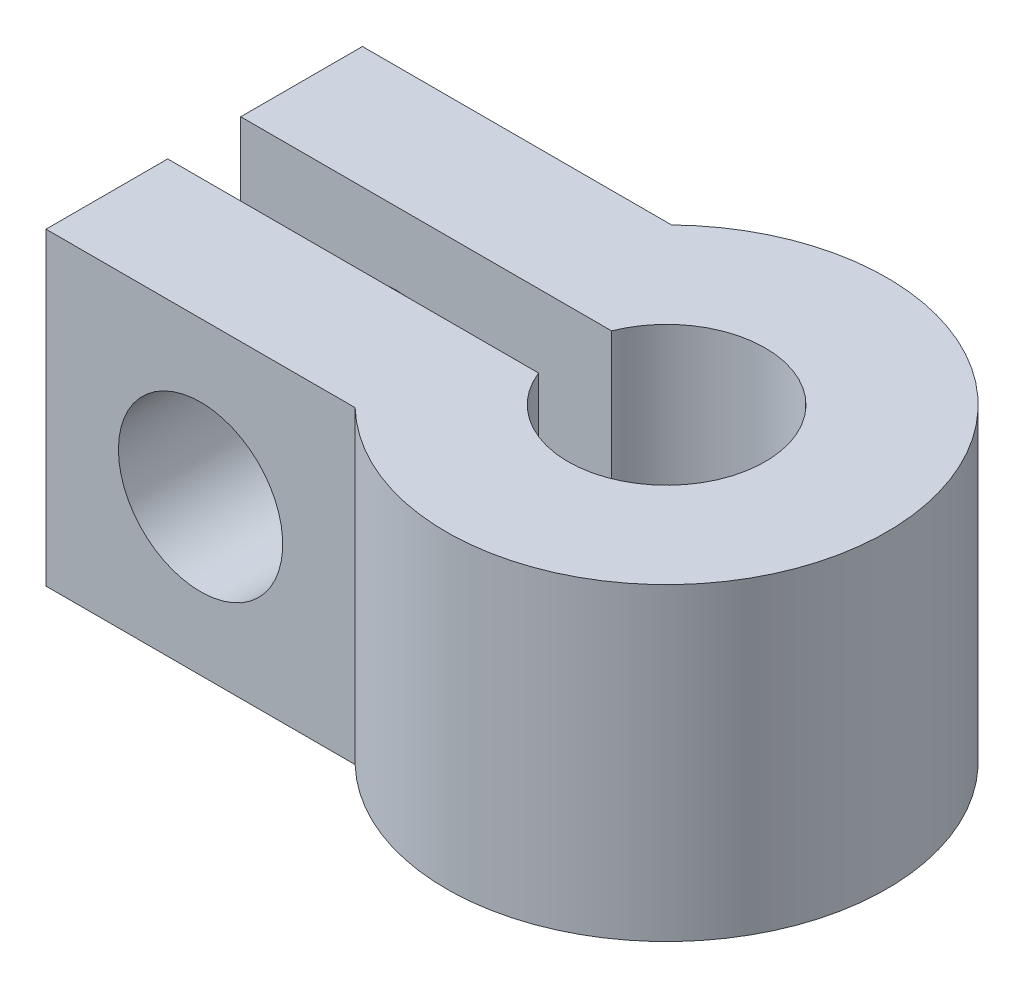
ISO-10303-21;
HEADER;
FILE_DESCRIPTION(('STEP AP214'),'2;1');
FILE_NAME('part.step','',(''),(''),'','','');
FILE_SCHEMA(('AUTOMOTIVE_DESIGN { 1 0 10303 214 1 1 1 1 }'));
ENDSEC;
DATA;
#1=APPLICATION_CONTEXT('core data for automotive mechanical design processes');
#2=APPLICATION_PROTOCOL_DEFINITION('international standard','automotive_design',2000,#1);
#3=PRODUCT_CONTEXT('',#1,'mechanical');
#4=PRODUCT('Part','Part','',(#3));
#5=PRODUCT_RELATED_PRODUCT_CATEGORY('part','',(#4));
#6=PRODUCT_DEFINITION_FORMATION('','',#4);
#7=PRODUCT_DEFINITION_CONTEXT('part definition',#1,'design');
#8=PRODUCT_DEFINITION('design','',#6,#7);
#9=PRODUCT_DEFINITION_SHAPE('','',#8);
#10=(LENGTH_UNIT() NAMED_UNIT(*) SI_UNIT(.MILLI.,.METRE.));
#11=(NAMED_UNIT(*) PLANE_ANGLE_UNIT() SI_UNIT($,.RADIAN.));
#12=(NAMED_UNIT(*) SI_UNIT($,.STERADIAN.) SOLID_ANGLE_UNIT());
#13=UNCERTAINTY_MEASURE_WITH_UNIT(LENGTH_MEASURE(1.E-05),#10,'distance_accuracy_value','');
#14=(GEOMETRIC_REPRESENTATION_CONTEXT(3) GLOBAL_UNCERTAINTY_ASSIGNED_CONTEXT((#13)) GLOBAL_UNIT_ASSIGNED_CONTEXT((#10,
#11,#12)) REPRESENTATION_CONTEXT('',''));
#15=CARTESIAN_POINT('',(0.,0.,0.));
#16=DIRECTION('',(0.,0.,1.));
#17=DIRECTION('',(1.,0.,0.));
#18=AXIS2_PLACEMENT_3D('',#15,#16,#17);
#19=CARTESIAN_POINT('',(0.,12.7,0.));
#20=DIRECTION('',(0.,-1.,0.));
#21=DIRECTION('',(0.,0.,-1.));
#22=AXIS2_PLACEMENT_3D('',#19,#20,#21);
#23=CYLINDRICAL_SURFACE('',#22,9.05);
#24=CARTESIAN_POINT('',(0.,0.,0.));
#25=DIRECTION('',(0.,1.,0.));
#26=DIRECTION('',(0.,0.,1.));
#27=AXIS2_PLACEMENT_3D('',#24,#25,#26);
#28=CIRCLE('',#27,9.05);
#29=CARTESIAN_POINT('',(-6.29702310619868,0.,-6.5));
#30=VERTEX_POINT('',#29);
#31=CARTESIAN_POINT('',(-6.29702310619868,0.,6.5));
#32=VERTEX_POINT('',#31);
#33=EDGE_CURVE('E128',#30,#32,#28,.F.);
#34=ORIENTED_EDGE('',*,*,#33,.F.);
#35=DIRECTION('',(0.,-1.,0.));
#36=VECTOR('',#35,1.);
#37=CARTESIAN_POINT('',(-6.29702310619868,12.7,-6.5));
#38=LINE('',#37,#36);
#39=CARTESIAN_POINT('',(-6.29702310619868,12.7,-6.5));
#40=VERTEX_POINT('',#39);
#41=EDGE_CURVE('E11',#40,#30,#38,.T.);
#42=ORIENTED_EDGE('',*,*,#41,.F.);
#43=CARTESIAN_POINT('',(0.,12.7,0.));
#44=DIRECTION('',(0.,1.,0.));
#45=DIRECTION('',(0.,0.,1.));
#46=AXIS2_PLACEMENT_3D('',#43,#44,#45);
#47=CIRCLE('',#46,9.05);
#48=CARTESIAN_POINT('',(-6.29702310619868,12.7,6.5));
#49=VERTEX_POINT('',#48);
#50=EDGE_CURVE('E148',#40,#49,#47,.F.);
#51=ORIENTED_EDGE('',*,*,#50,.T.);
#52=DIRECTION('',(0.,-1.,0.));
#53=VECTOR('',#52,1.);
#54=CARTESIAN_POINT('',(-6.29702310619868,12.7,6.5));
#55=LINE('',#54,#53);
#56=EDGE_CURVE('E87',#49,#32,#55,.T.);
#57=ORIENTED_EDGE('',*,*,#56,.T.);
#58=EDGE_LOOP('',(#34,#42,#51,#57));
#59=FACE_BOUND('',#58,.T.);
#60=ADVANCED_FACE('F35',(#59),#23,.T.);
#61=CARTESIAN_POINT('',(0.,12.7,-6.5));
#62=DIRECTION('',(0.,0.,-1.));
#63=DIRECTION('',(-1.,0.,0.));
#64=AXIS2_PLACEMENT_3D('',#61,#62,#63);
#65=PLANE('',#64);
#66=CARTESIAN_POINT('',(-12.6470231061987,6.35,-6.5));
#67=DIRECTION('',(0.,0.,-1.));
#68=DIRECTION('',(-1.,0.,0.));
#69=AXIS2_PLACEMENT_3D('',#66,#67,#68);
#70=CIRCLE('',#69,3.375);
#71=CARTESIAN_POINT('',(-16.0220231061987,6.35,-6.5));
#72=VERTEX_POINT('',#71);
#73=EDGE_CURVE('E191',#72,#72,#70,.T.);
#74=ORIENTED_EDGE('',*,*,#73,.F.);
#75=EDGE_LOOP('',(#74));
#76=FACE_BOUND('',#75,.T.);
#77=DIRECTION('',(1.,0.,0.));
#78=VECTOR('',#77,1.);
#79=CARTESIAN_POINT('',(0.,0.,-6.5));
#80=LINE('',#79,#78);
#81=CARTESIAN_POINT('',(-18.9970231061987,0.,-6.5));
#82=VERTEX_POINT('',#81);
#83=EDGE_CURVE('E131',#82,#30,#80,.T.);
#84=ORIENTED_EDGE('',*,*,#83,.F.);
#85=DIRECTION('',(0.,-1.,0.));
#86=VECTOR('',#85,1.);
#87=CARTESIAN_POINT('',(-18.9970231061987,12.7,-6.5));
#88=LINE('',#87,#86);
#89=CARTESIAN_POINT('',(-18.9970231061987,12.7,-6.5));
#90=VERTEX_POINT('',#89);
#91=EDGE_CURVE('E44',#90,#82,#88,.T.);
#92=ORIENTED_EDGE('',*,*,#91,.F.);
#93=DIRECTION('',(1.,0.,0.));
#94=VECTOR('',#93,1.);
#95=CARTESIAN_POINT('',(0.,12.7,-6.5));
#96=LINE('',#95,#94);
#97=EDGE_CURVE('E175',#90,#40,#96,.T.);
#98=ORIENTED_EDGE('',*,*,#97,.T.);
#99=ORIENTED_EDGE('',*,*,#41,.T.);
#100=EDGE_LOOP('',(#84,#92,#98,#99));
#101=FACE_BOUND('',#100,.T.);
#102=ADVANCED_FACE('F166',(#76,#101),#65,.T.);
#103=CARTESIAN_POINT('',(-18.9970231061987,12.7,0.));
#104=DIRECTION('',(-1.,0.,0.));
#105=DIRECTION('',(0.,0.,1.));
#106=AXIS2_PLACEMENT_3D('',#103,#104,#105);
#107=PLANE('',#106);
#108=DIRECTION('',(0.,0.,-1.));
#109=VECTOR('',#108,1.);
#110=CARTESIAN_POINT('',(-18.9970231061987,0.,0.));
#111=LINE('',#110,#109);
#112=CARTESIAN_POINT('',(-18.9970231061987,0.,-1.5));
#113=VERTEX_POINT('',#112);
#114=EDGE_CURVE('E135',#113,#82,#111,.T.);
#115=ORIENTED_EDGE('',*,*,#114,.F.);
#116=DIRECTION('',(0.,-1.,0.));
#117=VECTOR('',#116,1.);
#118=CARTESIAN_POINT('',(-18.9970231061987,12.7,-1.5));
#119=LINE('',#118,#117);
#120=CARTESIAN_POINT('',(-18.9970231061987,12.7,-1.5));
#121=VERTEX_POINT('',#120);
#122=EDGE_CURVE('E154',#121,#113,#119,.T.);
#123=ORIENTED_EDGE('',*,*,#122,.F.);
#124=DIRECTION('',(0.,0.,-1.));
#125=VECTOR('',#124,1.);
#126=CARTESIAN_POINT('',(-18.9970231061987,12.7,0.));
#127=LINE('',#126,#125);
#128=EDGE_CURVE('E162',#121,#90,#127,.T.);
#129=ORIENTED_EDGE('',*,*,#128,.T.);
#130=ORIENTED_EDGE('',*,*,#91,.T.);
#131=EDGE_LOOP('',(#115,#123,#129,#130));
#132=FACE_BOUND('',#131,.T.);
#133=ADVANCED_FACE('F160',(#132),#107,.T.);
#134=CARTESIAN_POINT('',(0.,12.7,-1.5));
#135=DIRECTION('',(0.,0.,1.));
#136=DIRECTION('',(1.,0.,0.));
#137=AXIS2_PLACEMENT_3D('',#134,#135,#136);
#138=PLANE('',#137);
#139=CARTESIAN_POINT('',(-12.6470231061987,6.35,-1.5));
#140=DIRECTION('',(0.,0.,1.));
#141=DIRECTION('',(1.,0.,0.));
#142=AXIS2_PLACEMENT_3D('',#139,#140,#141);
#143=CIRCLE('',#142,3.375);
#144=CARTESIAN_POINT('',(-9.27202310619868,6.35,-1.5));
#145=VERTEX_POINT('',#144);
#146=EDGE_CURVE('E132',#145,#145,#143,.T.);
#147=ORIENTED_EDGE('',*,*,#146,.F.);
#148=EDGE_LOOP('',(#147));
#149=FACE_BOUND('',#148,.T.);
#150=DIRECTION('',(-1.,0.,0.));
#151=VECTOR('',#150,1.);
#152=CARTESIAN_POINT('',(0.,0.,-1.5));
#153=LINE('',#152,#151);
#154=CARTESIAN_POINT('',(-3.76198086119534,0.,-1.5));
#155=VERTEX_POINT('',#154);
#156=EDGE_CURVE('E138',#155,#113,#153,.T.);
#157=ORIENTED_EDGE('',*,*,#156,.F.);
#158=DIRECTION('',(0.,-1.,0.));
#159=VECTOR('',#158,1.);
#160=CARTESIAN_POINT('',(-3.76198086119534,12.7,-1.5));
#161=LINE('',#160,#159);
#162=CARTESIAN_POINT('',(-3.76198086119534,12.7,-1.5));
#163=VERTEX_POINT('',#162);
#164=EDGE_CURVE('E152',#163,#155,#161,.T.);
#165=ORIENTED_EDGE('',*,*,#164,.F.);
#166=DIRECTION('',(-1.,0.,0.));
#167=VECTOR('',#166,1.);
#168=CARTESIAN_POINT('',(0.,12.7,-1.5));
#169=LINE('',#168,#167);
#170=EDGE_CURVE('E174',#163,#121,#169,.T.);
#171=ORIENTED_EDGE('',*,*,#170,.T.);
#172=ORIENTED_EDGE('',*,*,#122,.T.);
#173=EDGE_LOOP('',(#157,#165,#171,#172));
#174=FACE_BOUND('',#173,.T.);
#175=ADVANCED_FACE('F172',(#149,#174),#138,.T.);
#176=CARTESIAN_POINT('',(0.,12.7,0.));
#177=DIRECTION('',(0.,-1.,0.));
#178=DIRECTION('',(0.,0.,-1.));
#179=AXIS2_PLACEMENT_3D('',#176,#177,#178);
#180=CYLINDRICAL_SURFACE('',#179,4.05);
#181=CARTESIAN_POINT('',(0.,0.,0.));
#182=DIRECTION('',(0.,1.,0.));
#183=DIRECTION('',(0.,0.,1.));
#184=AXIS2_PLACEMENT_3D('',#181,#182,#183);
#185=CIRCLE('',#184,4.05);
#186=CARTESIAN_POINT('',(-3.76198086119534,0.,1.5));
#187=VERTEX_POINT('',#186);
#188=EDGE_CURVE('E141',#187,#155,#185,.T.);
#189=ORIENTED_EDGE('',*,*,#188,.F.);
#190=DIRECTION('',(0.,-1.,0.));
#191=VECTOR('',#190,1.);
#192=CARTESIAN_POINT('',(-3.76198086119534,12.7,1.5));
#193=LINE('',#192,#191);
#194=CARTESIAN_POINT('',(-3.76198086119534,12.7,1.5));
#195=VERTEX_POINT('',#194);
#196=EDGE_CURVE('E120',#195,#187,#193,.T.);
#197=ORIENTED_EDGE('',*,*,#196,.F.);
#198=CARTESIAN_POINT('',(0.,12.7,0.));
#199=DIRECTION('',(0.,1.,0.));
#200=DIRECTION('',(0.,0.,1.));
#201=AXIS2_PLACEMENT_3D('',#198,#199,#200);
#202=CIRCLE('',#201,4.05);
#203=EDGE_CURVE('E113',#195,#163,#202,.T.);
#204=ORIENTED_EDGE('',*,*,#203,.T.);
#205=ORIENTED_EDGE('',*,*,#164,.T.);
#206=EDGE_LOOP('',(#189,#197,#204,#205));
#207=FACE_BOUND('',#206,.T.);
#208=ADVANCED_FACE('F181',(#207),#180,.F.);
#209=CARTESIAN_POINT('',(0.,12.7,1.5));
#210=DIRECTION('',(0.,0.,1.));
#211=DIRECTION('',(1.,0.,0.));
#212=AXIS2_PLACEMENT_3D('',#209,#210,#211);
#213=PLANE('',#212);
#214=CARTESIAN_POINT('',(-12.6470231061987,6.35,1.5));
#215=DIRECTION('',(0.,0.,1.));
#216=DIRECTION('',(1.,0.,0.));
#217=AXIS2_PLACEMENT_3D('',#214,#215,#216);
#218=CIRCLE('',#217,3.375);
#219=CARTESIAN_POINT('',(-9.27202310619868,6.35,1.5));
#220=VERTEX_POINT('',#219);
#221=EDGE_CURVE('E188',#220,#220,#218,.T.);
#222=ORIENTED_EDGE('',*,*,#221,.T.);
#223=EDGE_LOOP('',(#222));
#224=FACE_BOUND('',#223,.T.);
#225=DIRECTION('',(-1.,0.,0.));
#226=VECTOR('',#225,1.);
#227=CARTESIAN_POINT('',(0.,0.,1.5));
#228=LINE('',#227,#226);
#229=CARTESIAN_POINT('',(-18.9970231061987,0.,1.5));
#230=VERTEX_POINT('',#229);
#231=EDGE_CURVE('E119',#187,#230,#228,.T.);
#232=ORIENTED_EDGE('',*,*,#231,.T.);
#233=DIRECTION('',(0.,-1.,0.));
#234=VECTOR('',#233,1.);
#235=CARTESIAN_POINT('',(-18.9970231061987,12.7,1.5));
#236=LINE('',#235,#234);
#237=CARTESIAN_POINT('',(-18.9970231061987,12.7,1.5));
#238=VERTEX_POINT('',#237);
#239=EDGE_CURVE('E116',#238,#230,#236,.T.);
#240=ORIENTED_EDGE('',*,*,#239,.F.);
#241=DIRECTION('',(-1.,0.,0.));
#242=VECTOR('',#241,1.);
#243=CARTESIAN_POINT('',(0.,12.7,1.5));
#244=LINE('',#243,#242);
#245=EDGE_CURVE('E106',#195,#238,#244,.T.);
#246=ORIENTED_EDGE('',*,*,#245,.F.);
#247=ORIENTED_EDGE('',*,*,#196,.T.);
#248=EDGE_LOOP('',(#232,#240,#246,#247));
#249=FACE_BOUND('',#248,.T.);
#250=ADVANCED_FACE('F117',(#224,#249),#213,.F.);
#251=CARTESIAN_POINT('',(-18.9970231061987,12.7,0.));
#252=DIRECTION('',(1.,0.,0.));
#253=DIRECTION('',(0.,0.,-1.));
#254=AXIS2_PLACEMENT_3D('',#251,#252,#253);
#255=PLANE('',#254);
#256=DIRECTION('',(0.,0.,1.));
#257=VECTOR('',#256,1.);
#258=CARTESIAN_POINT('',(-18.9970231061987,0.,0.));
#259=LINE('',#258,#257);
#260=CARTESIAN_POINT('',(-18.9970231061987,0.,6.5));
#261=VERTEX_POINT('',#260);
#262=EDGE_CURVE('E80',#230,#261,#259,.T.);
#263=ORIENTED_EDGE('',*,*,#262,.T.);
#264=DIRECTION('',(0.,-1.,0.));
#265=VECTOR('',#264,1.);
#266=CARTESIAN_POINT('',(-18.9970231061987,12.7,6.5));
#267=LINE('',#266,#265);
#268=CARTESIAN_POINT('',(-18.9970231061987,12.7,6.5));
#269=VERTEX_POINT('',#268);
#270=EDGE_CURVE('E121',#269,#261,#267,.T.);
#271=ORIENTED_EDGE('',*,*,#270,.F.);
#272=DIRECTION('',(0.,0.,1.));
#273=VECTOR('',#272,1.);
#274=CARTESIAN_POINT('',(-18.9970231061987,12.7,0.));
#275=LINE('',#274,#273);
#276=EDGE_CURVE('E110',#238,#269,#275,.T.);
#277=ORIENTED_EDGE('',*,*,#276,.F.);
#278=ORIENTED_EDGE('',*,*,#239,.T.);
#279=EDGE_LOOP('',(#263,#271,#277,#278));
#280=FACE_BOUND('',#279,.T.);
#281=ADVANCED_FACE('F123',(#280),#255,.F.);
#282=CARTESIAN_POINT('',(0.,12.7,6.5));
#283=DIRECTION('',(0.,0.,-1.));
#284=DIRECTION('',(-1.,0.,0.));
#285=AXIS2_PLACEMENT_3D('',#282,#283,#284);
#286=PLANE('',#285);
#287=CARTESIAN_POINT('',(-12.6470231061987,6.35,6.5));
#288=DIRECTION('',(0.,0.,-1.));
#289=DIRECTION('',(-1.,0.,0.));
#290=AXIS2_PLACEMENT_3D('',#287,#288,#289);
#291=CIRCLE('',#290,3.375);
#292=CARTESIAN_POINT('',(-16.0220231061987,6.35,6.5));
#293=VERTEX_POINT('',#292);
#294=EDGE_CURVE('E38',#293,#293,#291,.T.);
#295=ORIENTED_EDGE('',*,*,#294,.T.);
#296=EDGE_LOOP('',(#295));
#297=FACE_BOUND('',#296,.T.);
#298=DIRECTION('',(1.,0.,0.));
#299=VECTOR('',#298,1.);
#300=CARTESIAN_POINT('',(0.,0.,6.5));
#301=LINE('',#300,#299);
#302=EDGE_CURVE('E146',#261,#32,#301,.T.);
#303=ORIENTED_EDGE('',*,*,#302,.T.);
#304=ORIENTED_EDGE('',*,*,#56,.F.);
#305=DIRECTION('',(1.,0.,0.));
#306=VECTOR('',#305,1.);
#307=CARTESIAN_POINT('',(0.,12.7,6.5));
#308=LINE('',#307,#306);
#309=EDGE_CURVE('E52',#269,#49,#308,.T.);
#310=ORIENTED_EDGE('',*,*,#309,.F.);
#311=ORIENTED_EDGE('',*,*,#270,.T.);
#312=EDGE_LOOP('',(#303,#304,#310,#311));
#313=FACE_BOUND('',#312,.T.);
#314=ADVANCED_FACE('F184',(#297,#313),#286,.F.);
#315=CARTESIAN_POINT('',(0.,12.7,0.));
#316=DIRECTION('',(0.,1.,0.));
#317=DIRECTION('',(0.,0.,1.));
#318=AXIS2_PLACEMENT_3D('',#315,#316,#317);
#319=PLANE('',#318);
#320=ORIENTED_EDGE('',*,*,#50,.F.);
#321=ORIENTED_EDGE('',*,*,#97,.F.);
#322=ORIENTED_EDGE('',*,*,#128,.F.);
#323=ORIENTED_EDGE('',*,*,#170,.F.);
#324=ORIENTED_EDGE('',*,*,#203,.F.);
#325=ORIENTED_EDGE('',*,*,#245,.T.);
#326=ORIENTED_EDGE('',*,*,#276,.T.);
#327=ORIENTED_EDGE('',*,*,#309,.T.);
#328=EDGE_LOOP('',(#320,#321,#322,#323,#324,#325,#326,#327));
#329=FACE_BOUND('',#328,.T.);
#330=ADVANCED_FACE('F108',(#329),#319,.T.);
#331=CARTESIAN_POINT('',(0.,0.,0.));
#332=DIRECTION('',(0.,1.,0.));
#333=DIRECTION('',(0.,0.,1.));
#334=AXIS2_PLACEMENT_3D('',#331,#332,#333);
#335=PLANE('',#334);
#336=ORIENTED_EDGE('',*,*,#33,.T.);
#337=ORIENTED_EDGE('',*,*,#302,.F.);
#338=ORIENTED_EDGE('',*,*,#262,.F.);
#339=ORIENTED_EDGE('',*,*,#231,.F.);
#340=ORIENTED_EDGE('',*,*,#188,.T.);
#341=ORIENTED_EDGE('',*,*,#156,.T.);
#342=ORIENTED_EDGE('',*,*,#114,.T.);
#343=ORIENTED_EDGE('',*,*,#83,.T.);
#344=EDGE_LOOP('',(#336,#337,#338,#339,#340,#341,#342,#343));
#345=FACE_BOUND('',#344,.T.);
#346=ADVANCED_FACE('F168',(#345),#335,.F.);
#347=CARTESIAN_POINT('',(-12.6470231061987,6.35,9.05));
#348=DIRECTION('',(0.,0.,-1.));
#349=DIRECTION('',(-1.,0.,0.));
#350=AXIS2_PLACEMENT_3D('',#347,#348,#349);
#351=CYLINDRICAL_SURFACE('',#350,3.375);
#352=ORIENTED_EDGE('',*,*,#294,.F.);
#353=EDGE_LOOP('',(#352));
#354=FACE_BOUND('',#353,.T.);
#355=ORIENTED_EDGE('',*,*,#221,.F.);
#356=EDGE_LOOP('',(#355));
#357=FACE_BOUND('',#356,.T.);
#358=ADVANCED_FACE('F199',(#354,#357),#351,.F.);
#359=ORIENTED_EDGE('',*,*,#146,.T.);
#360=EDGE_LOOP('',(#359));
#361=FACE_BOUND('',#360,.T.);
#362=ORIENTED_EDGE('',*,*,#73,.T.);
#363=EDGE_LOOP('',(#362));
#364=FACE_BOUND('',#363,.T.);
#365=ADVANCED_FACE('F202',(#361,#364),#351,.F.);
#366=CLOSED_SHELL('',(#60,#102,#133,#175,#208,#250,#281,#314,#330,#346,#358,#365));
#367=MANIFOLD_SOLID_BREP('B2',#366);
#368=ADVANCED_BREP_SHAPE_REPRESENTATION('',(#18,#367),#14);
#369=SHAPE_DEFINITION_REPRESENTATION(#9,#368);
ENDSEC;
END-ISO-10303-21;
